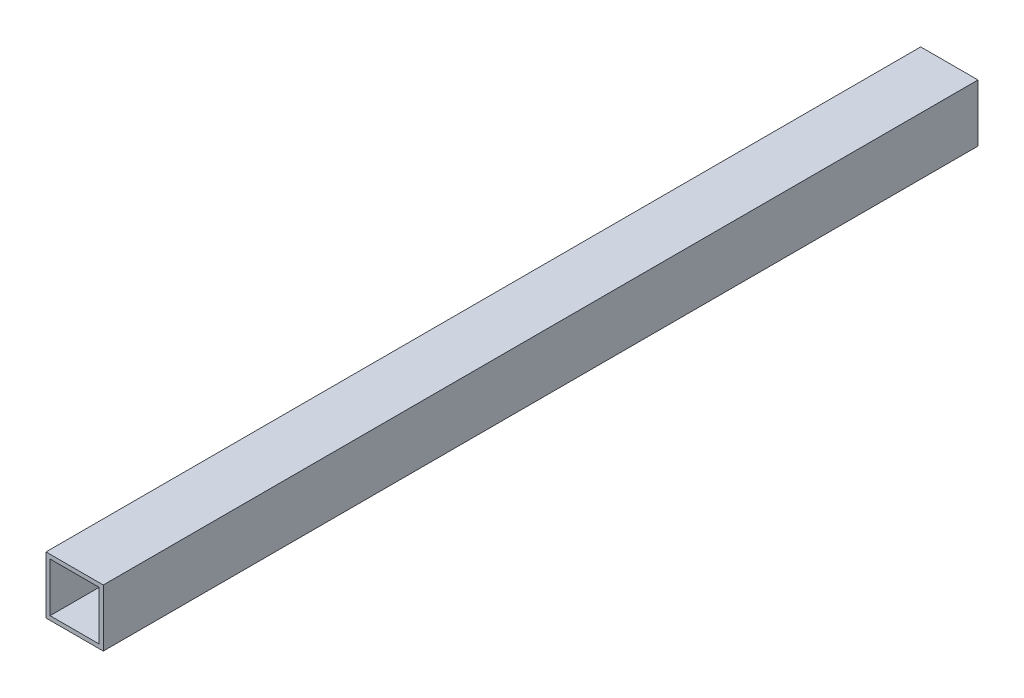
ISO-10303-21;
HEADER;
FILE_DESCRIPTION(('STEP AP214'),'2;1');
FILE_NAME('part.step','',(''),(''),'','','');
FILE_SCHEMA(('AUTOMOTIVE_DESIGN { 1 0 10303 214 1 1 1 1 }'));
ENDSEC;
DATA;
#1=APPLICATION_CONTEXT('core data for automotive mechanical design processes');
#2=APPLICATION_PROTOCOL_DEFINITION('international standard','automotive_design',2000,#1);
#3=PRODUCT_CONTEXT('',#1,'mechanical');
#4=PRODUCT('Part','Part','',(#3));
#5=PRODUCT_RELATED_PRODUCT_CATEGORY('part','',(#4));
#6=PRODUCT_DEFINITION_FORMATION('','',#4);
#7=PRODUCT_DEFINITION_CONTEXT('part definition',#1,'design');
#8=PRODUCT_DEFINITION('design','',#6,#7);
#9=PRODUCT_DEFINITION_SHAPE('','',#8);
#10=(LENGTH_UNIT() NAMED_UNIT(*) SI_UNIT(.MILLI.,.METRE.));
#11=(NAMED_UNIT(*) PLANE_ANGLE_UNIT() SI_UNIT($,.RADIAN.));
#12=(NAMED_UNIT(*) SI_UNIT($,.STERADIAN.) SOLID_ANGLE_UNIT());
#13=UNCERTAINTY_MEASURE_WITH_UNIT(LENGTH_MEASURE(1.E-05),#10,'distance_accuracy_value','');
#14=(GEOMETRIC_REPRESENTATION_CONTEXT(3) GLOBAL_UNCERTAINTY_ASSIGNED_CONTEXT((#13)) GLOBAL_UNIT_ASSIGNED_CONTEXT((#10,
#11,#12)) REPRESENTATION_CONTEXT('',''));
#15=CARTESIAN_POINT('',(0.,0.,0.));
#16=DIRECTION('',(0.,0.,1.));
#17=DIRECTION('',(1.,0.,0.));
#18=AXIS2_PLACEMENT_3D('',#15,#16,#17);
#19=CARTESIAN_POINT('',(0.,0.,678.815));
#20=DIRECTION('',(0.,0.,-1.));
#21=DIRECTION('',(-1.,0.,0.));
#22=AXIS2_PLACEMENT_3D('',#19,#20,#21);
#23=PLANE('',#22);
#24=DIRECTION('',(0.,1.,0.));
#25=VECTOR('',#24,1.);
#26=CARTESIAN_POINT('',(22.225,-22.2249999999999,678.815));
#27=LINE('',#26,#25);
#28=CARTESIAN_POINT('',(22.225,-22.2249999999999,678.815));
#29=VERTEX_POINT('',#28);
#30=CARTESIAN_POINT('',(22.225,22.2250000000001,678.815));
#31=VERTEX_POINT('',#30);
#32=EDGE_CURVE('E133',#29,#31,#27,.T.);
#33=ORIENTED_EDGE('',*,*,#32,.T.);
#34=DIRECTION('',(-1.,0.,0.));
#35=VECTOR('',#34,1.);
#36=CARTESIAN_POINT('',(-22.225,22.2250000000001,678.815));
#37=LINE('',#36,#35);
#38=CARTESIAN_POINT('',(-22.225,22.2250000000001,678.815));
#39=VERTEX_POINT('',#38);
#40=EDGE_CURVE('E136',#31,#39,#37,.T.);
#41=ORIENTED_EDGE('',*,*,#40,.T.);
#42=DIRECTION('',(0.,-1.,0.));
#43=VECTOR('',#42,1.);
#44=CARTESIAN_POINT('',(-22.225,-22.2249999999999,678.815));
#45=LINE('',#44,#43);
#46=CARTESIAN_POINT('',(-22.225,-22.2249999999999,678.815));
#47=VERTEX_POINT('',#46);
#48=EDGE_CURVE('E139',#39,#47,#45,.T.);
#49=ORIENTED_EDGE('',*,*,#48,.T.);
#50=DIRECTION('',(1.,0.,0.));
#51=VECTOR('',#50,1.);
#52=CARTESIAN_POINT('',(-22.225,-22.2249999999999,678.815));
#53=LINE('',#52,#51);
#54=EDGE_CURVE('E141',#47,#29,#53,.T.);
#55=ORIENTED_EDGE('',*,*,#54,.T.);
#56=EDGE_LOOP('',(#33,#41,#49,#55));
#57=FACE_BOUND('',#56,.T.);
#58=DIRECTION('',(1.,0.,0.));
#59=VECTOR('',#58,1.);
#60=CARTESIAN_POINT('',(-19.05,-19.0499999999999,678.815));
#61=LINE('',#60,#59);
#62=CARTESIAN_POINT('',(-19.05,-19.0499999999999,678.815));
#63=VERTEX_POINT('',#62);
#64=CARTESIAN_POINT('',(19.05,-19.0499999999999,678.815));
#65=VERTEX_POINT('',#64);
#66=EDGE_CURVE('E97',#63,#65,#61,.T.);
#67=ORIENTED_EDGE('',*,*,#66,.F.);
#68=DIRECTION('',(0.,-1.,0.));
#69=VECTOR('',#68,1.);
#70=CARTESIAN_POINT('',(-19.05,-19.0499999999999,678.815));
#71=LINE('',#70,#69);
#72=CARTESIAN_POINT('',(-19.05,19.0500000000001,678.815));
#73=VERTEX_POINT('',#72);
#74=EDGE_CURVE('E119',#73,#63,#71,.T.);
#75=ORIENTED_EDGE('',*,*,#74,.F.);
#76=DIRECTION('',(-1.,0.,0.));
#77=VECTOR('',#76,1.);
#78=CARTESIAN_POINT('',(-19.05,19.0500000000001,678.815));
#79=LINE('',#78,#77);
#80=CARTESIAN_POINT('',(19.05,19.0500000000001,678.815));
#81=VERTEX_POINT('',#80);
#82=EDGE_CURVE('E117',#81,#73,#79,.T.);
#83=ORIENTED_EDGE('',*,*,#82,.F.);
#84=DIRECTION('',(0.,1.,0.));
#85=VECTOR('',#84,1.);
#86=CARTESIAN_POINT('',(19.05,-19.0499999999999,678.815));
#87=LINE('',#86,#85);
#88=EDGE_CURVE('E105',#65,#81,#87,.T.);
#89=ORIENTED_EDGE('',*,*,#88,.F.);
#90=EDGE_LOOP('',(#67,#75,#83,#89));
#91=FACE_BOUND('',#90,.T.);
#92=ADVANCED_FACE('F32',(#57,#91),#23,.F.);
#93=CARTESIAN_POINT('',(0.,0.,0.));
#94=DIRECTION('',(0.,0.,-1.));
#95=DIRECTION('',(-1.,0.,0.));
#96=AXIS2_PLACEMENT_3D('',#93,#94,#95);
#97=PLANE('',#96);
#98=DIRECTION('',(0.,1.,0.));
#99=VECTOR('',#98,1.);
#100=CARTESIAN_POINT('',(22.225,-22.2249999999999,0.));
#101=LINE('',#100,#99);
#102=CARTESIAN_POINT('',(22.225,-22.2249999999999,0.));
#103=VERTEX_POINT('',#102);
#104=CARTESIAN_POINT('',(22.225,22.2250000000001,0.));
#105=VERTEX_POINT('',#104);
#106=EDGE_CURVE('E113',#103,#105,#101,.T.);
#107=ORIENTED_EDGE('',*,*,#106,.F.);
#108=DIRECTION('',(1.,0.,0.));
#109=VECTOR('',#108,1.);
#110=CARTESIAN_POINT('',(-22.225,-22.2249999999999,0.));
#111=LINE('',#110,#109);
#112=CARTESIAN_POINT('',(-22.225,-22.2249999999999,0.));
#113=VERTEX_POINT('',#112);
#114=EDGE_CURVE('E137',#113,#103,#111,.T.);
#115=ORIENTED_EDGE('',*,*,#114,.F.);
#116=DIRECTION('',(0.,-1.,0.));
#117=VECTOR('',#116,1.);
#118=CARTESIAN_POINT('',(-22.225,-22.2249999999999,0.));
#119=LINE('',#118,#117);
#120=CARTESIAN_POINT('',(-22.225,22.2250000000001,0.));
#121=VERTEX_POINT('',#120);
#122=EDGE_CURVE('E148',#121,#113,#119,.T.);
#123=ORIENTED_EDGE('',*,*,#122,.F.);
#124=DIRECTION('',(-1.,0.,0.));
#125=VECTOR('',#124,1.);
#126=CARTESIAN_POINT('',(-22.225,22.2250000000001,0.));
#127=LINE('',#126,#125);
#128=EDGE_CURVE('E146',#105,#121,#127,.T.);
#129=ORIENTED_EDGE('',*,*,#128,.F.);
#130=EDGE_LOOP('',(#107,#115,#123,#129));
#131=FACE_BOUND('',#130,.T.);
#132=DIRECTION('',(0.,-1.,0.));
#133=VECTOR('',#132,1.);
#134=CARTESIAN_POINT('',(-19.05,-19.0499999999999,0.));
#135=LINE('',#134,#133);
#136=CARTESIAN_POINT('',(-19.05,19.0500000000001,0.));
#137=VERTEX_POINT('',#136);
#138=CARTESIAN_POINT('',(-19.05,-19.0499999999999,0.));
#139=VERTEX_POINT('',#138);
#140=EDGE_CURVE('E106',#137,#139,#135,.T.);
#141=ORIENTED_EDGE('',*,*,#140,.T.);
#142=DIRECTION('',(1.,0.,0.));
#143=VECTOR('',#142,1.);
#144=CARTESIAN_POINT('',(-19.05,-19.0499999999999,0.));
#145=LINE('',#144,#143);
#146=CARTESIAN_POINT('',(19.05,-19.0499999999999,0.));
#147=VERTEX_POINT('',#146);
#148=EDGE_CURVE('E55',#139,#147,#145,.T.);
#149=ORIENTED_EDGE('',*,*,#148,.T.);
#150=DIRECTION('',(0.,1.,0.));
#151=VECTOR('',#150,1.);
#152=CARTESIAN_POINT('',(19.05,-19.0499999999999,0.));
#153=LINE('',#152,#151);
#154=CARTESIAN_POINT('',(19.05,19.0500000000001,0.));
#155=VERTEX_POINT('',#154);
#156=EDGE_CURVE('E112',#147,#155,#153,.T.);
#157=ORIENTED_EDGE('',*,*,#156,.T.);
#158=DIRECTION('',(-1.,0.,0.));
#159=VECTOR('',#158,1.);
#160=CARTESIAN_POINT('',(-19.05,19.0500000000001,0.));
#161=LINE('',#160,#159);
#162=EDGE_CURVE('E125',#155,#137,#161,.T.);
#163=ORIENTED_EDGE('',*,*,#162,.T.);
#164=EDGE_LOOP('',(#141,#149,#157,#163));
#165=FACE_BOUND('',#164,.T.);
#166=ADVANCED_FACE('F166',(#131,#165),#97,.T.);
#167=CARTESIAN_POINT('',(22.225,-22.2249999999999,678.815));
#168=DIRECTION('',(-1.,0.,0.));
#169=DIRECTION('',(0.,0.,1.));
#170=AXIS2_PLACEMENT_3D('',#167,#168,#169);
#171=PLANE('',#170);
#172=ORIENTED_EDGE('',*,*,#106,.T.);
#173=DIRECTION('',(0.,0.,-1.));
#174=VECTOR('',#173,1.);
#175=CARTESIAN_POINT('',(22.225,22.2250000000001,678.815));
#176=LINE('',#175,#174);
#177=EDGE_CURVE('E11',#31,#105,#176,.T.);
#178=ORIENTED_EDGE('',*,*,#177,.F.);
#179=ORIENTED_EDGE('',*,*,#32,.F.);
#180=DIRECTION('',(0.,0.,-1.));
#181=VECTOR('',#180,1.);
#182=CARTESIAN_POINT('',(22.225,-22.2249999999999,678.815));
#183=LINE('',#182,#181);
#184=EDGE_CURVE('E143',#29,#103,#183,.T.);
#185=ORIENTED_EDGE('',*,*,#184,.T.);
#186=EDGE_LOOP('',(#172,#178,#179,#185));
#187=FACE_BOUND('',#186,.T.);
#188=ADVANCED_FACE('F34',(#187),#171,.F.);
#189=CARTESIAN_POINT('',(-22.225,22.2250000000001,678.815));
#190=DIRECTION('',(0.,-1.,0.));
#191=DIRECTION('',(0.,0.,-1.));
#192=AXIS2_PLACEMENT_3D('',#189,#190,#191);
#193=PLANE('',#192);
#194=ORIENTED_EDGE('',*,*,#128,.T.);
#195=DIRECTION('',(0.,0.,-1.));
#196=VECTOR('',#195,1.);
#197=CARTESIAN_POINT('',(-22.225,22.2250000000001,678.815));
#198=LINE('',#197,#196);
#199=EDGE_CURVE('E40',#39,#121,#198,.T.);
#200=ORIENTED_EDGE('',*,*,#199,.F.);
#201=ORIENTED_EDGE('',*,*,#40,.F.);
#202=ORIENTED_EDGE('',*,*,#177,.T.);
#203=EDGE_LOOP('',(#194,#200,#201,#202));
#204=FACE_BOUND('',#203,.T.);
#205=ADVANCED_FACE('F176',(#204),#193,.F.);
#206=CARTESIAN_POINT('',(-22.225,-22.2249999999999,678.815));
#207=DIRECTION('',(1.,0.,0.));
#208=DIRECTION('',(0.,0.,-1.));
#209=AXIS2_PLACEMENT_3D('',#206,#207,#208);
#210=PLANE('',#209);
#211=ORIENTED_EDGE('',*,*,#122,.T.);
#212=DIRECTION('',(0.,0.,-1.));
#213=VECTOR('',#212,1.);
#214=CARTESIAN_POINT('',(-22.225,-22.2249999999999,678.815));
#215=LINE('',#214,#213);
#216=EDGE_CURVE('E153',#47,#113,#215,.T.);
#217=ORIENTED_EDGE('',*,*,#216,.F.);
#218=ORIENTED_EDGE('',*,*,#48,.F.);
#219=ORIENTED_EDGE('',*,*,#199,.T.);
#220=EDGE_LOOP('',(#211,#217,#218,#219));
#221=FACE_BOUND('',#220,.T.);
#222=ADVANCED_FACE('F160',(#221),#210,.F.);
#223=CARTESIAN_POINT('',(-22.225,-22.2249999999999,678.815));
#224=DIRECTION('',(0.,1.,0.));
#225=DIRECTION('',(0.,0.,1.));
#226=AXIS2_PLACEMENT_3D('',#223,#224,#225);
#227=PLANE('',#226);
#228=ORIENTED_EDGE('',*,*,#114,.T.);
#229=ORIENTED_EDGE('',*,*,#184,.F.);
#230=ORIENTED_EDGE('',*,*,#54,.F.);
#231=ORIENTED_EDGE('',*,*,#216,.T.);
#232=EDGE_LOOP('',(#228,#229,#230,#231));
#233=FACE_BOUND('',#232,.T.);
#234=ADVANCED_FACE('F170',(#233),#227,.F.);
#235=CARTESIAN_POINT('',(-19.05,-19.0499999999999,678.815));
#236=DIRECTION('',(0.,1.,0.));
#237=DIRECTION('',(0.,0.,1.));
#238=AXIS2_PLACEMENT_3D('',#235,#236,#237);
#239=PLANE('',#238);
#240=ORIENTED_EDGE('',*,*,#148,.F.);
#241=DIRECTION('',(0.,0.,-1.));
#242=VECTOR('',#241,1.);
#243=CARTESIAN_POINT('',(-19.05,-19.0499999999999,678.815));
#244=LINE('',#243,#242);
#245=EDGE_CURVE('E101',#63,#139,#244,.T.);
#246=ORIENTED_EDGE('',*,*,#245,.F.);
#247=ORIENTED_EDGE('',*,*,#66,.T.);
#248=DIRECTION('',(0.,0.,-1.));
#249=VECTOR('',#248,1.);
#250=CARTESIAN_POINT('',(19.05,-19.0499999999999,678.815));
#251=LINE('',#250,#249);
#252=EDGE_CURVE('E100',#65,#147,#251,.T.);
#253=ORIENTED_EDGE('',*,*,#252,.T.);
#254=EDGE_LOOP('',(#240,#246,#247,#253));
#255=FACE_BOUND('',#254,.T.);
#256=ADVANCED_FACE('F99',(#255),#239,.T.);
#257=CARTESIAN_POINT('',(19.05,-19.0499999999999,678.815));
#258=DIRECTION('',(-1.,0.,0.));
#259=DIRECTION('',(0.,-1.,0.));
#260=AXIS2_PLACEMENT_3D('',#257,#258,#259);
#261=PLANE('',#260);
#262=ORIENTED_EDGE('',*,*,#156,.F.);
#263=ORIENTED_EDGE('',*,*,#252,.F.);
#264=ORIENTED_EDGE('',*,*,#88,.T.);
#265=DIRECTION('',(0.,0.,-1.));
#266=VECTOR('',#265,1.);
#267=CARTESIAN_POINT('',(19.05,19.0500000000001,678.815));
#268=LINE('',#267,#266);
#269=EDGE_CURVE('E114',#81,#155,#268,.T.);
#270=ORIENTED_EDGE('',*,*,#269,.T.);
#271=EDGE_LOOP('',(#262,#263,#264,#270));
#272=FACE_BOUND('',#271,.T.);
#273=ADVANCED_FACE('F109',(#272),#261,.T.);
#274=CARTESIAN_POINT('',(-19.05,19.0500000000001,678.815));
#275=DIRECTION('',(0.,-1.,0.));
#276=DIRECTION('',(1.,0.,0.));
#277=AXIS2_PLACEMENT_3D('',#274,#275,#276);
#278=PLANE('',#277);
#279=ORIENTED_EDGE('',*,*,#162,.F.);
#280=ORIENTED_EDGE('',*,*,#269,.F.);
#281=ORIENTED_EDGE('',*,*,#82,.T.);
#282=DIRECTION('',(0.,0.,-1.));
#283=VECTOR('',#282,1.);
#284=CARTESIAN_POINT('',(-19.05,19.0500000000001,678.815));
#285=LINE('',#284,#283);
#286=EDGE_CURVE('E47',#73,#137,#285,.T.);
#287=ORIENTED_EDGE('',*,*,#286,.T.);
#288=EDGE_LOOP('',(#279,#280,#281,#287));
#289=FACE_BOUND('',#288,.T.);
#290=ADVANCED_FACE('F199',(#289),#278,.T.);
#291=CARTESIAN_POINT('',(-19.05,-19.0499999999999,678.815));
#292=DIRECTION('',(1.,0.,0.));
#293=DIRECTION('',(0.,0.,-1.));
#294=AXIS2_PLACEMENT_3D('',#291,#292,#293);
#295=PLANE('',#294);
#296=ORIENTED_EDGE('',*,*,#140,.F.);
#297=ORIENTED_EDGE('',*,*,#286,.F.);
#298=ORIENTED_EDGE('',*,*,#74,.T.);
#299=ORIENTED_EDGE('',*,*,#245,.T.);
#300=EDGE_LOOP('',(#296,#297,#298,#299));
#301=FACE_BOUND('',#300,.T.);
#302=ADVANCED_FACE('F203',(#301),#295,.T.);
#303=CLOSED_SHELL('',(#92,#166,#188,#205,#222,#234,#256,#273,#290,#302));
#304=MANIFOLD_SOLID_BREP('B2',#303);
#305=ADVANCED_BREP_SHAPE_REPRESENTATION('',(#18,#304),#14);
#306=SHAPE_DEFINITION_REPRESENTATION(#9,#305);
ENDSEC;
END-ISO-10303-21;
